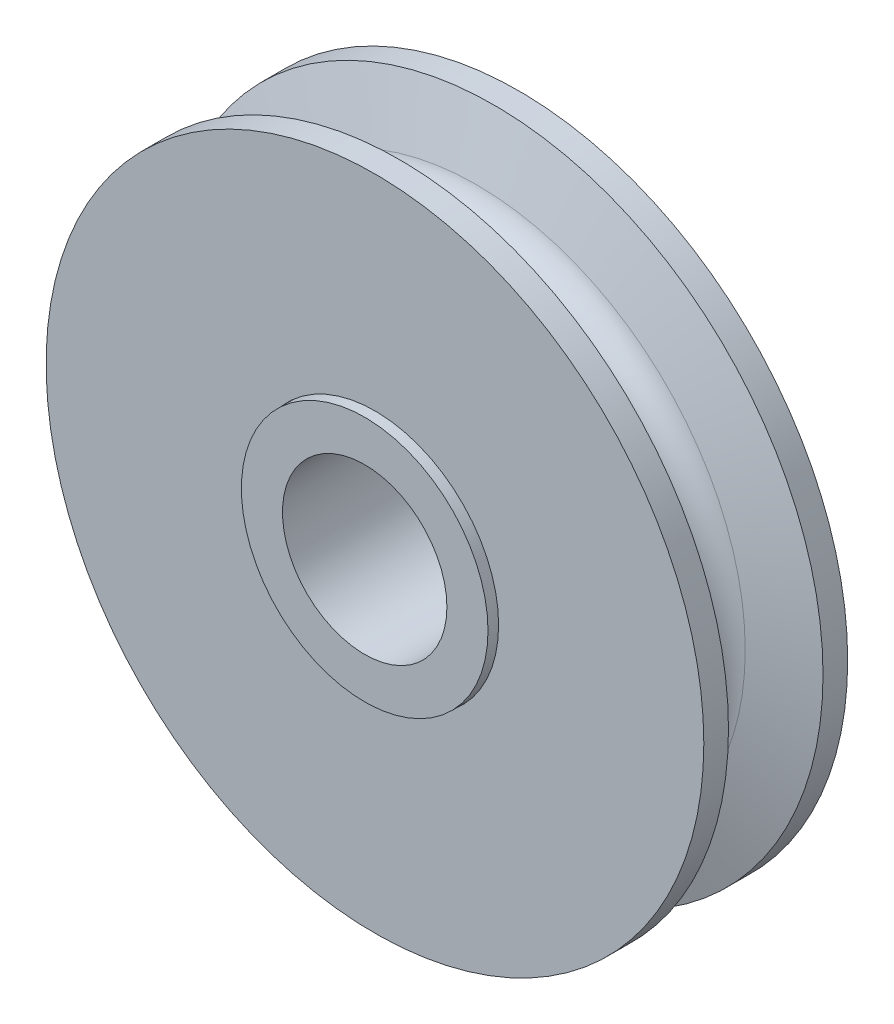
ISO-10303-21;
HEADER;
FILE_DESCRIPTION(('STEP AP214'),'2;1');
FILE_NAME('part.step','',(''),(''),'','','');
FILE_SCHEMA(('AUTOMOTIVE_DESIGN { 1 0 10303 214 1 1 1 1 }'));
ENDSEC;
DATA;
#1=APPLICATION_CONTEXT('core data for automotive mechanical design processes');
#2=APPLICATION_PROTOCOL_DEFINITION('international standard','automotive_design',2000,#1);
#3=PRODUCT_CONTEXT('',#1,'mechanical');
#4=PRODUCT('Part','Part','',(#3));
#5=PRODUCT_RELATED_PRODUCT_CATEGORY('part','',(#4));
#6=PRODUCT_DEFINITION_FORMATION('','',#4);
#7=PRODUCT_DEFINITION_CONTEXT('part definition',#1,'design');
#8=PRODUCT_DEFINITION('design','',#6,#7);
#9=PRODUCT_DEFINITION_SHAPE('','',#8);
#10=(LENGTH_UNIT() NAMED_UNIT(*) SI_UNIT(.MILLI.,.METRE.));
#11=(NAMED_UNIT(*) PLANE_ANGLE_UNIT() SI_UNIT($,.RADIAN.));
#12=(NAMED_UNIT(*) SI_UNIT($,.STERADIAN.) SOLID_ANGLE_UNIT());
#13=UNCERTAINTY_MEASURE_WITH_UNIT(LENGTH_MEASURE(1.E-05),#10,'distance_accuracy_value','');
#14=(GEOMETRIC_REPRESENTATION_CONTEXT(3) GLOBAL_UNCERTAINTY_ASSIGNED_CONTEXT((#13)) GLOBAL_UNIT_ASSIGNED_CONTEXT((#10,
#11,#12)) REPRESENTATION_CONTEXT('',''));
#15=CARTESIAN_POINT('',(0.,0.,0.));
#16=DIRECTION('',(0.,0.,1.));
#17=DIRECTION('',(1.,0.,0.));
#18=AXIS2_PLACEMENT_3D('',#15,#16,#17);
#19=CARTESIAN_POINT('',(0.,0.,0.));
#20=DIRECTION('',(0.,0.,1.));
#21=DIRECTION('',(1.,0.,0.));
#22=AXIS2_PLACEMENT_3D('',#19,#20,#21);
#23=TOROIDAL_SURFACE('',#22,21.43125,2.38125);
#24=CARTESIAN_POINT('',(0.,0.,2.28424095516216));
#25=DIRECTION('',(0.,0.,1.));
#26=DIRECTION('',(1.,0.,0.));
#27=AXIS2_PLACEMENT_3D('',#24,#25,#26);
#28=CIRCLE('',#27,20.7584983212508);
#29=CARTESIAN_POINT('',(20.7584983212508,0.,2.28424095516216));
#30=VERTEX_POINT('',#29);
#31=EDGE_CURVE('E70',#30,#30,#28,.T.);
#32=ORIENTED_EDGE('',*,*,#31,.F.);
#33=EDGE_LOOP('',(#32));
#34=FACE_BOUND('',#33,.T.);
#35=CARTESIAN_POINT('',(0.,0.,-2.28424095516216));
#36=DIRECTION('',(0.,0.,1.));
#37=DIRECTION('',(1.,0.,0.));
#38=AXIS2_PLACEMENT_3D('',#35,#36,#37);
#39=CIRCLE('',#38,20.7584983212508);
#40=CARTESIAN_POINT('',(20.7584983212508,0.,-2.28424095516216));
#41=VERTEX_POINT('',#40);
#42=EDGE_CURVE('E68',#41,#41,#39,.T.);
#43=ORIENTED_EDGE('',*,*,#42,.T.);
#44=EDGE_LOOP('',(#43));
#45=FACE_BOUND('',#44,.T.);
#46=ADVANCED_FACE('F52',(#34,#45),#23,.F.);
#47=CARTESIAN_POINT('',(0.,0.,2.28424095516216));
#48=DIRECTION('',(0.,0.,1.));
#49=DIRECTION('',(1.,0.,0.));
#50=AXIS2_PLACEMENT_3D('',#47,#48,#49);
#51=CONICAL_SURFACE('',#50,20.7584983212508,1.28437580232397);
#52=CARTESIAN_POINT('',(0.,0.,3.65125));
#53=DIRECTION('',(0.,0.,1.));
#54=DIRECTION('',(1.,0.,0.));
#55=AXIS2_PLACEMENT_3D('',#52,#53,#54);
#56=CIRCLE('',#55,25.4);
#57=CARTESIAN_POINT('',(25.4,0.,3.65125));
#58=VERTEX_POINT('',#57);
#59=EDGE_CURVE('E74',#58,#58,#56,.T.);
#60=ORIENTED_EDGE('',*,*,#59,.F.);
#61=EDGE_LOOP('',(#60));
#62=FACE_BOUND('',#61,.T.);
#63=ORIENTED_EDGE('',*,*,#31,.T.);
#64=EDGE_LOOP('',(#63));
#65=FACE_BOUND('',#64,.T.);
#66=ADVANCED_FACE('F101',(#62,#65),#51,.T.);
#67=CARTESIAN_POINT('',(0.,0.,6.35));
#68=DIRECTION('',(0.,0.,1.));
#69=DIRECTION('',(1.,0.,0.));
#70=AXIS2_PLACEMENT_3D('',#67,#68,#69);
#71=CYLINDRICAL_SURFACE('',#70,25.4);
#72=CARTESIAN_POINT('',(0.,0.,5.55625));
#73=DIRECTION('',(0.,0.,1.));
#74=DIRECTION('',(1.,0.,0.));
#75=AXIS2_PLACEMENT_3D('',#72,#73,#74);
#76=CIRCLE('',#75,25.4);
#77=CARTESIAN_POINT('',(25.4,0.,5.55625));
#78=VERTEX_POINT('',#77);
#79=EDGE_CURVE('E81',#78,#78,#76,.T.);
#80=ORIENTED_EDGE('',*,*,#79,.F.);
#81=EDGE_LOOP('',(#80));
#82=FACE_BOUND('',#81,.T.);
#83=ORIENTED_EDGE('',*,*,#59,.T.);
#84=EDGE_LOOP('',(#83));
#85=FACE_BOUND('',#84,.T.);
#86=ADVANCED_FACE('F107',(#82,#85),#71,.T.);
#87=CARTESIAN_POINT('',(0.,9.525,5.55625));
#88=DIRECTION('',(0.,0.,-1.));
#89=DIRECTION('',(-1.,0.,0.));
#90=AXIS2_PLACEMENT_3D('',#87,#88,#89);
#91=PLANE('',#90);
#92=CARTESIAN_POINT('',(0.,0.,5.55625));
#93=DIRECTION('',(0.,0.,-1.));
#94=DIRECTION('',(-1.,0.,0.));
#95=AXIS2_PLACEMENT_3D('',#92,#93,#94);
#96=CIRCLE('',#95,9.5504);
#97=CARTESIAN_POINT('',(9.5504,0.,5.55625));
#98=VERTEX_POINT('',#97);
#99=EDGE_CURVE('E56',#98,#98,#96,.T.);
#100=ORIENTED_EDGE('',*,*,#99,.T.);
#101=EDGE_LOOP('',(#100));
#102=FACE_BOUND('',#101,.T.);
#103=ORIENTED_EDGE('',*,*,#79,.T.);
#104=EDGE_LOOP('',(#103));
#105=FACE_BOUND('',#104,.T.);
#106=ADVANCED_FACE('F89',(#102,#105),#91,.F.);
#107=CARTESIAN_POINT('',(0.,25.4,-5.55625));
#108=DIRECTION('',(0.,0.,1.));
#109=DIRECTION('',(1.,0.,0.));
#110=AXIS2_PLACEMENT_3D('',#107,#108,#109);
#111=PLANE('',#110);
#112=CARTESIAN_POINT('',(0.,0.,-5.55625));
#113=DIRECTION('',(0.,0.,1.));
#114=DIRECTION('',(1.,0.,0.));
#115=AXIS2_PLACEMENT_3D('',#112,#113,#114);
#116=CIRCLE('',#115,9.5504);
#117=CARTESIAN_POINT('',(9.5504,0.,-5.55625));
#118=VERTEX_POINT('',#117);
#119=EDGE_CURVE('E65',#118,#118,#116,.T.);
#120=ORIENTED_EDGE('',*,*,#119,.T.);
#121=EDGE_LOOP('',(#120));
#122=FACE_BOUND('',#121,.T.);
#123=CARTESIAN_POINT('',(0.,0.,-5.55625));
#124=DIRECTION('',(0.,0.,1.));
#125=DIRECTION('',(1.,0.,0.));
#126=AXIS2_PLACEMENT_3D('',#123,#124,#125);
#127=CIRCLE('',#126,25.4);
#128=CARTESIAN_POINT('',(25.4,0.,-5.55625));
#129=VERTEX_POINT('',#128);
#130=EDGE_CURVE('E60',#129,#129,#127,.T.);
#131=ORIENTED_EDGE('',*,*,#130,.F.);
#132=EDGE_LOOP('',(#131));
#133=FACE_BOUND('',#132,.T.);
#134=ADVANCED_FACE('F116',(#122,#133),#111,.F.);
#135=CARTESIAN_POINT('',(0.,0.,6.35));
#136=DIRECTION('',(0.,0.,1.));
#137=DIRECTION('',(1.,0.,0.));
#138=AXIS2_PLACEMENT_3D('',#135,#136,#137);
#139=CYLINDRICAL_SURFACE('',#138,25.4);
#140=CARTESIAN_POINT('',(0.,0.,-3.65125));
#141=DIRECTION('',(0.,0.,1.));
#142=DIRECTION('',(1.,0.,0.));
#143=AXIS2_PLACEMENT_3D('',#140,#141,#142);
#144=CIRCLE('',#143,25.4);
#145=CARTESIAN_POINT('',(25.4,0.,-3.65125));
#146=VERTEX_POINT('',#145);
#147=EDGE_CURVE('E12',#146,#146,#144,.T.);
#148=ORIENTED_EDGE('',*,*,#147,.F.);
#149=EDGE_LOOP('',(#148));
#150=FACE_BOUND('',#149,.T.);
#151=ORIENTED_EDGE('',*,*,#130,.T.);
#152=EDGE_LOOP('',(#151));
#153=FACE_BOUND('',#152,.T.);
#154=ADVANCED_FACE('F97',(#150,#153),#139,.T.);
#155=CARTESIAN_POINT('',(0.,0.,-3.65125));
#156=DIRECTION('',(0.,0.,-1.));
#157=DIRECTION('',(-1.,0.,0.));
#158=AXIS2_PLACEMENT_3D('',#155,#156,#157);
#159=CONICAL_SURFACE('',#158,25.4,1.28437580232397);
#160=ORIENTED_EDGE('',*,*,#42,.F.);
#161=EDGE_LOOP('',(#160));
#162=FACE_BOUND('',#161,.T.);
#163=ORIENTED_EDGE('',*,*,#147,.T.);
#164=EDGE_LOOP('',(#163));
#165=FACE_BOUND('',#164,.T.);
#166=ADVANCED_FACE('F92',(#162,#165),#159,.T.);
#167=CARTESIAN_POINT('',(0.,0.,-6.35));
#168=DIRECTION('',(0.,0.,1.));
#169=DIRECTION('',(1.,0.,0.));
#170=AXIS2_PLACEMENT_3D('',#167,#168,#169);
#171=CYLINDRICAL_SURFACE('',#170,9.5504);
#172=CARTESIAN_POINT('',(9.5504,0.,-5.55625));
#173=CARTESIAN_POINT('',(9.5504,0.,-5.44049479166667));
#174=CARTESIAN_POINT('',(9.5504,0.,-5.32473958333333));
#175=CARTESIAN_POINT('',(9.5504,0.,-5.09322916666667));
#176=CARTESIAN_POINT('',(9.5504,0.,-4.97747395833333));
#177=CARTESIAN_POINT('',(9.5504,0.,-4.74596354166667));
#178=CARTESIAN_POINT('',(9.5504,0.,-4.63020833333333));
#179=CARTESIAN_POINT('',(9.5504,0.,-4.39869791666667));
#180=CARTESIAN_POINT('',(9.5504,0.,-4.28294270833333));
#181=CARTESIAN_POINT('',(9.5504,0.,-4.05143229166667));
#182=CARTESIAN_POINT('',(9.5504,0.,-3.93567708333333));
#183=CARTESIAN_POINT('',(9.5504,0.,-3.70416666666667));
#184=CARTESIAN_POINT('',(9.5504,0.,-3.58841145833333));
#185=CARTESIAN_POINT('',(9.5504,0.,-3.35690104166667));
#186=CARTESIAN_POINT('',(9.5504,0.,-3.24114583333333));
#187=CARTESIAN_POINT('',(9.5504,0.,-3.00963541666667));
#188=CARTESIAN_POINT('',(9.5504,0.,-2.89388020833333));
#189=CARTESIAN_POINT('',(9.5504,0.,-2.66236979166667));
#190=CARTESIAN_POINT('',(9.5504,0.,-2.54661458333333));
#191=CARTESIAN_POINT('',(9.5504,0.,-2.31510416666667));
#192=CARTESIAN_POINT('',(9.5504,0.,-2.19934895833333));
#193=CARTESIAN_POINT('',(9.5504,0.,-1.96783854166667));
#194=CARTESIAN_POINT('',(9.5504,0.,-1.85208333333333));
#195=CARTESIAN_POINT('',(9.5504,0.,-1.62057291666667));
#196=CARTESIAN_POINT('',(9.5504,0.,-1.50481770833333));
#197=CARTESIAN_POINT('',(9.5504,0.,-1.27330729166667));
#198=CARTESIAN_POINT('',(9.5504,0.,-1.15755208333333));
#199=CARTESIAN_POINT('',(9.5504,0.,-0.926041666666667));
#200=CARTESIAN_POINT('',(9.5504,0.,-0.810286458333333));
#201=CARTESIAN_POINT('',(9.5504,0.,-0.578776041666666));
#202=CARTESIAN_POINT('',(9.5504,0.,-0.463020833333333));
#203=CARTESIAN_POINT('',(9.5504,0.,-0.231510416666666));
#204=CARTESIAN_POINT('',(9.5504,0.,-0.115755208333333));
#205=CARTESIAN_POINT('',(9.5504,0.,0.115755208333334));
#206=CARTESIAN_POINT('',(9.5504,0.,0.231510416666667));
#207=CARTESIAN_POINT('',(9.5504,0.,0.463020833333334));
#208=CARTESIAN_POINT('',(9.5504,0.,0.578776041666667));
#209=CARTESIAN_POINT('',(9.5504,0.,0.810286458333333));
#210=CARTESIAN_POINT('',(9.5504,0.,0.926041666666667));
#211=CARTESIAN_POINT('',(9.5504,0.,1.15755208333333));
#212=CARTESIAN_POINT('',(9.5504,0.,1.27330729166667));
#213=CARTESIAN_POINT('',(9.5504,0.,1.50481770833333));
#214=CARTESIAN_POINT('',(9.5504,0.,1.62057291666667));
#215=CARTESIAN_POINT('',(9.5504,0.,1.85208333333333));
#216=CARTESIAN_POINT('',(9.5504,0.,1.96783854166667));
#217=CARTESIAN_POINT('',(9.5504,0.,2.19934895833333));
#218=CARTESIAN_POINT('',(9.5504,0.,2.31510416666667));
#219=CARTESIAN_POINT('',(9.5504,0.,2.54661458333333));
#220=CARTESIAN_POINT('',(9.5504,0.,2.66236979166667));
#221=CARTESIAN_POINT('',(9.5504,0.,2.89388020833333));
#222=CARTESIAN_POINT('',(9.5504,0.,3.00963541666667));
#223=CARTESIAN_POINT('',(9.5504,0.,3.24114583333333));
#224=CARTESIAN_POINT('',(9.5504,0.,3.35690104166667));
#225=CARTESIAN_POINT('',(9.5504,0.,3.58841145833333));
#226=CARTESIAN_POINT('',(9.5504,0.,3.70416666666667));
#227=CARTESIAN_POINT('',(9.5504,0.,3.93567708333333));
#228=CARTESIAN_POINT('',(9.5504,0.,4.05143229166667));
#229=CARTESIAN_POINT('',(9.5504,0.,4.28294270833333));
#230=CARTESIAN_POINT('',(9.5504,0.,4.39869791666667));
#231=CARTESIAN_POINT('',(9.5504,0.,4.63020833333333));
#232=CARTESIAN_POINT('',(9.5504,0.,4.74596354166667));
#233=CARTESIAN_POINT('',(9.5504,0.,4.97747395833333));
#234=CARTESIAN_POINT('',(9.5504,0.,5.09322916666667));
#235=CARTESIAN_POINT('',(9.5504,0.,5.32473958333333));
#236=CARTESIAN_POINT('',(9.5504,0.,5.44049479166667));
#237=CARTESIAN_POINT('',(9.5504,0.,5.55625));
#238=B_SPLINE_CURVE_WITH_KNOTS('',3,(#172,#173,#174,#175,#176,#177,#178,#179,#180,#181,#182,
#183,#184,#185,#186,#187,#188,#189,#190,#191,#192,#193,#194,#195,#196,#197,#198,#199,#200,#201,
#202,#203,#204,#205,#206,#207,#208,#209,#210,#211,#212,#213,#214,#215,#216,#217,#218,#219,#220,
#221,#222,#223,#224,#225,#226,#227,#228,#229,#230,#231,#232,#233,#234,#235,#236,#237),
.UNSPECIFIED.,.F.,.F.,(4,2,2,2,2,2,2,2,2,2,2,2,2,2,2,2,2,2,2,2,2,2,2,2,2,2,2,2,2,2,2,2,4),(0.,
0.347265625,0.694531250000001,1.041796875,1.3890625,1.736328125,2.08359375,2.430859375,2.778125,
3.125390625,3.47265625,3.819921875,4.1671875,4.514453125,4.86171875,5.208984375,5.55625,
5.903515625,6.25078125,6.598046875,6.9453125,7.292578125,7.63984375,7.987109375,8.334375,
8.681640625,9.02890625,9.376171875,9.7234375,10.070703125,10.41796875,10.765234375,11.1125),.UNSPECIFIED.);
#239=EDGE_CURVE('BSEAM54',#118,#98,#238,.T.);
#240=ORIENTED_EDGE('',*,*,#119,.F.);
#241=ORIENTED_EDGE('',*,*,#99,.F.);
#242=ORIENTED_EDGE('',*,*,#239,.T.);
#243=ORIENTED_EDGE('',*,*,#239,.F.);
#244=EDGE_LOOP('',(#240,#242,#241,#243));
#245=FACE_BOUND('',#244,.T.);
#246=ADVANCED_FACE('F54',(#245),#171,.F.);
#247=CLOSED_SHELL('',(#46,#66,#86,#106,#134,#154,#166,#246));
#248=MANIFOLD_SOLID_BREP('B2',#247);
#249=CARTESIAN_POINT('',(0.,9.525,6.35));
#250=DIRECTION('',(0.,0.,-1.));
#251=DIRECTION('',(-1.,0.,0.));
#252=AXIS2_PLACEMENT_3D('',#249,#250,#251);
#253=PLANE('',#252);
#254=CARTESIAN_POINT('',(0.,0.,6.35));
#255=DIRECTION('',(0.,0.,1.));
#256=DIRECTION('',(1.,0.,0.));
#257=AXIS2_PLACEMENT_3D('',#254,#255,#256);
#258=CIRCLE('',#257,6.35);
#259=CARTESIAN_POINT('',(6.35,0.,6.35));
#260=VERTEX_POINT('',#259);
#261=EDGE_CURVE('E179',#260,#260,#258,.T.);
#262=ORIENTED_EDGE('',*,*,#261,.F.);
#263=EDGE_LOOP('',(#262));
#264=FACE_BOUND('',#263,.T.);
#265=CARTESIAN_POINT('',(0.,0.,6.35));
#266=DIRECTION('',(0.,0.,1.));
#267=DIRECTION('',(1.,0.,0.));
#268=AXIS2_PLACEMENT_3D('',#265,#266,#267);
#269=CIRCLE('',#268,9.525);
#270=CARTESIAN_POINT('',(9.525,0.,6.35));
#271=VERTEX_POINT('',#270);
#272=EDGE_CURVE('E51',#271,#271,#269,.T.);
#273=ORIENTED_EDGE('',*,*,#272,.T.);
#274=EDGE_LOOP('',(#273));
#275=FACE_BOUND('',#274,.T.);
#276=ADVANCED_FACE('F173',(#264,#275),#253,.F.);
#277=CARTESIAN_POINT('',(0.,0.,6.35));
#278=DIRECTION('',(0.,0.,1.));
#279=DIRECTION('',(1.,0.,0.));
#280=AXIS2_PLACEMENT_3D('',#277,#278,#279);
#281=CYLINDRICAL_SURFACE('',#280,6.35);
#282=CARTESIAN_POINT('',(0.,0.,-6.35));
#283=DIRECTION('',(0.,0.,1.));
#284=DIRECTION('',(1.,0.,0.));
#285=AXIS2_PLACEMENT_3D('',#282,#283,#284);
#286=CIRCLE('',#285,6.35);
#287=CARTESIAN_POINT('',(6.35,0.,-6.35));
#288=VERTEX_POINT('',#287);
#289=EDGE_CURVE('E183',#288,#288,#286,.T.);
#290=ORIENTED_EDGE('',*,*,#289,.F.);
#291=EDGE_LOOP('',(#290));
#292=FACE_BOUND('',#291,.T.);
#293=ORIENTED_EDGE('',*,*,#261,.T.);
#294=EDGE_LOOP('',(#293));
#295=FACE_BOUND('',#294,.T.);
#296=ADVANCED_FACE('F199',(#292,#295),#281,.F.);
#297=CARTESIAN_POINT('',(0.,9.525,-6.35));
#298=DIRECTION('',(0.,0.,1.));
#299=DIRECTION('',(1.,0.,0.));
#300=AXIS2_PLACEMENT_3D('',#297,#298,#299);
#301=PLANE('',#300);
#302=CARTESIAN_POINT('',(0.,0.,-6.35));
#303=DIRECTION('',(0.,0.,1.));
#304=DIRECTION('',(1.,0.,0.));
#305=AXIS2_PLACEMENT_3D('',#302,#303,#304);
#306=CIRCLE('',#305,9.525);
#307=CARTESIAN_POINT('',(9.525,0.,-6.35));
#308=VERTEX_POINT('',#307);
#309=EDGE_CURVE('E187',#308,#308,#306,.T.);
#310=ORIENTED_EDGE('',*,*,#309,.F.);
#311=EDGE_LOOP('',(#310));
#312=FACE_BOUND('',#311,.T.);
#313=ORIENTED_EDGE('',*,*,#289,.T.);
#314=EDGE_LOOP('',(#313));
#315=FACE_BOUND('',#314,.T.);
#316=ADVANCED_FACE('F196',(#312,#315),#301,.F.);
#317=CARTESIAN_POINT('',(0.,0.,6.35));
#318=DIRECTION('',(0.,0.,1.));
#319=DIRECTION('',(1.,0.,0.));
#320=AXIS2_PLACEMENT_3D('',#317,#318,#319);
#321=CYLINDRICAL_SURFACE('',#320,9.525);
#322=ORIENTED_EDGE('',*,*,#309,.T.);
#323=EDGE_LOOP('',(#322));
#324=FACE_BOUND('',#323,.T.);
#325=ORIENTED_EDGE('',*,*,#272,.F.);
#326=EDGE_LOOP('',(#325));
#327=FACE_BOUND('',#326,.T.);
#328=ADVANCED_FACE('F193',(#324,#327),#321,.T.);
#329=CLOSED_SHELL('',(#276,#296,#316,#328));
#330=MANIFOLD_SOLID_BREP('B7',#329);
#331=ADVANCED_BREP_SHAPE_REPRESENTATION('',(#18,#248,#330),#14);
#332=SHAPE_DEFINITION_REPRESENTATION(#9,#331);
ENDSEC;
END-ISO-10303-21;
